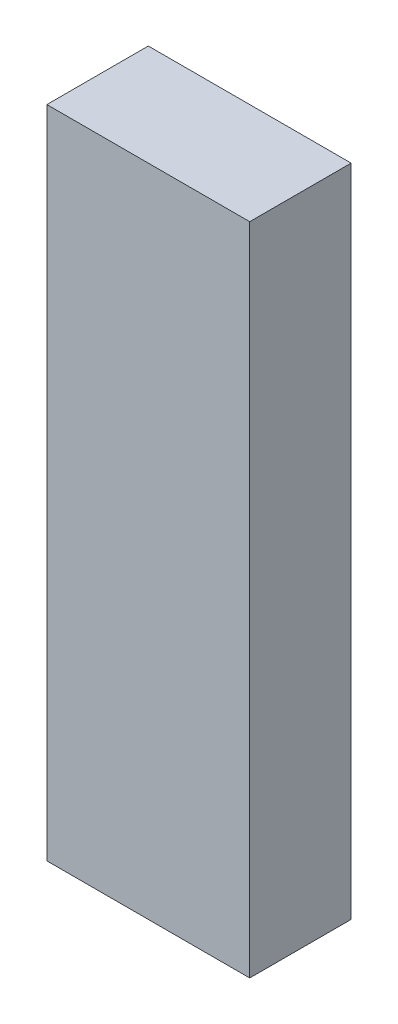
ISO-10303-21;
HEADER;
FILE_DESCRIPTION(('STEP AP214'),'2;1');
FILE_NAME('part.step','',(''),(''),'','','');
FILE_SCHEMA(('AUTOMOTIVE_DESIGN { 1 0 10303 214 1 1 1 1 }'));
ENDSEC;
DATA;
#1=APPLICATION_CONTEXT('core data for automotive mechanical design processes');
#2=APPLICATION_PROTOCOL_DEFINITION('international standard','automotive_design',2000,#1);
#3=PRODUCT_CONTEXT('',#1,'mechanical');
#4=PRODUCT('Part','Part','',(#3));
#5=PRODUCT_RELATED_PRODUCT_CATEGORY('part','',(#4));
#6=PRODUCT_DEFINITION_FORMATION('','',#4);
#7=PRODUCT_DEFINITION_CONTEXT('part definition',#1,'design');
#8=PRODUCT_DEFINITION('design','',#6,#7);
#9=PRODUCT_DEFINITION_SHAPE('','',#8);
#10=(LENGTH_UNIT() NAMED_UNIT(*) SI_UNIT(.MILLI.,.METRE.));
#11=(NAMED_UNIT(*) PLANE_ANGLE_UNIT() SI_UNIT($,.RADIAN.));
#12=(NAMED_UNIT(*) SI_UNIT($,.STERADIAN.) SOLID_ANGLE_UNIT());
#13=UNCERTAINTY_MEASURE_WITH_UNIT(LENGTH_MEASURE(1.E-05),#10,'distance_accuracy_value','');
#14=(GEOMETRIC_REPRESENTATION_CONTEXT(3) GLOBAL_UNCERTAINTY_ASSIGNED_CONTEXT((#13)) GLOBAL_UNIT_ASSIGNED_CONTEXT((#10,
#11,#12)) REPRESENTATION_CONTEXT('',''));
#15=CARTESIAN_POINT('',(0.,0.,0.));
#16=DIRECTION('',(0.,0.,1.));
#17=DIRECTION('',(1.,0.,0.));
#18=AXIS2_PLACEMENT_3D('',#15,#16,#17);
#19=CARTESIAN_POINT('',(24.,-77.5,24.));
#20=DIRECTION('',(-1.,0.,0.));
#21=DIRECTION('',(0.,0.,1.));
#22=AXIS2_PLACEMENT_3D('',#19,#20,#21);
#23=PLANE('',#22);
#24=DIRECTION('',(0.,1.,0.));
#25=VECTOR('',#24,1.);
#26=CARTESIAN_POINT('',(24.,-77.5,0.));
#27=LINE('',#26,#25);
#28=CARTESIAN_POINT('',(24.,-77.5,0.));
#29=VERTEX_POINT('',#28);
#30=CARTESIAN_POINT('',(24.,77.5,0.));
#31=VERTEX_POINT('',#30);
#32=EDGE_CURVE('E111',#29,#31,#27,.T.);
#33=ORIENTED_EDGE('',*,*,#32,.T.);
#34=DIRECTION('',(0.,0.,-1.));
#35=VECTOR('',#34,1.);
#36=CARTESIAN_POINT('',(24.,77.5,24.));
#37=LINE('',#36,#35);
#38=CARTESIAN_POINT('',(24.,77.5,24.));
#39=VERTEX_POINT('',#38);
#40=EDGE_CURVE('E11',#39,#31,#37,.T.);
#41=ORIENTED_EDGE('',*,*,#40,.F.);
#42=DIRECTION('',(0.,1.,0.));
#43=VECTOR('',#42,1.);
#44=CARTESIAN_POINT('',(24.,-77.5,24.));
#45=LINE('',#44,#43);
#46=CARTESIAN_POINT('',(24.,-77.5,24.));
#47=VERTEX_POINT('',#46);
#48=EDGE_CURVE('E95',#47,#39,#45,.T.);
#49=ORIENTED_EDGE('',*,*,#48,.F.);
#50=DIRECTION('',(0.,0.,-1.));
#51=VECTOR('',#50,1.);
#52=CARTESIAN_POINT('',(24.,-77.5,24.));
#53=LINE('',#52,#51);
#54=EDGE_CURVE('E107',#47,#29,#53,.T.);
#55=ORIENTED_EDGE('',*,*,#54,.T.);
#56=EDGE_LOOP('',(#33,#41,#49,#55));
#57=FACE_BOUND('',#56,.T.);
#58=ADVANCED_FACE('F43',(#57),#23,.F.);
#59=CARTESIAN_POINT('',(-24.,77.5,24.));
#60=DIRECTION('',(0.,-1.,0.));
#61=DIRECTION('',(0.,0.,-1.));
#62=AXIS2_PLACEMENT_3D('',#59,#60,#61);
#63=PLANE('',#62);
#64=DIRECTION('',(-1.,0.,0.));
#65=VECTOR('',#64,1.);
#66=CARTESIAN_POINT('',(-24.,77.5,0.));
#67=LINE('',#66,#65);
#68=CARTESIAN_POINT('',(-24.,77.5,0.));
#69=VERTEX_POINT('',#68);
#70=EDGE_CURVE('E100',#31,#69,#67,.T.);
#71=ORIENTED_EDGE('',*,*,#70,.T.);
#72=DIRECTION('',(0.,0.,-1.));
#73=VECTOR('',#72,1.);
#74=CARTESIAN_POINT('',(-24.,77.5,24.));
#75=LINE('',#74,#73);
#76=CARTESIAN_POINT('',(-24.,77.5,24.));
#77=VERTEX_POINT('',#76);
#78=EDGE_CURVE('E52',#77,#69,#75,.T.);
#79=ORIENTED_EDGE('',*,*,#78,.F.);
#80=DIRECTION('',(-1.,0.,0.));
#81=VECTOR('',#80,1.);
#82=CARTESIAN_POINT('',(-24.,77.5,24.));
#83=LINE('',#82,#81);
#84=EDGE_CURVE('E90',#39,#77,#83,.T.);
#85=ORIENTED_EDGE('',*,*,#84,.F.);
#86=ORIENTED_EDGE('',*,*,#40,.T.);
#87=EDGE_LOOP('',(#71,#79,#85,#86));
#88=FACE_BOUND('',#87,.T.);
#89=ADVANCED_FACE('F99',(#88),#63,.F.);
#90=CARTESIAN_POINT('',(-24.,-77.5,24.));
#91=DIRECTION('',(1.,0.,0.));
#92=DIRECTION('',(0.,0.,-1.));
#93=AXIS2_PLACEMENT_3D('',#90,#91,#92);
#94=PLANE('',#93);
#95=DIRECTION('',(0.,-1.,0.));
#96=VECTOR('',#95,1.);
#97=CARTESIAN_POINT('',(-24.,-77.5,0.));
#98=LINE('',#97,#96);
#99=CARTESIAN_POINT('',(-24.,-77.5,0.));
#100=VERTEX_POINT('',#99);
#101=EDGE_CURVE('E77',#69,#100,#98,.T.);
#102=ORIENTED_EDGE('',*,*,#101,.T.);
#103=DIRECTION('',(0.,0.,-1.));
#104=VECTOR('',#103,1.);
#105=CARTESIAN_POINT('',(-24.,-77.5,24.));
#106=LINE('',#105,#104);
#107=CARTESIAN_POINT('',(-24.,-77.5,24.));
#108=VERTEX_POINT('',#107);
#109=EDGE_CURVE('E102',#108,#100,#106,.T.);
#110=ORIENTED_EDGE('',*,*,#109,.F.);
#111=DIRECTION('',(0.,-1.,0.));
#112=VECTOR('',#111,1.);
#113=CARTESIAN_POINT('',(-24.,-77.5,24.));
#114=LINE('',#113,#112);
#115=EDGE_CURVE('E93',#77,#108,#114,.T.);
#116=ORIENTED_EDGE('',*,*,#115,.F.);
#117=ORIENTED_EDGE('',*,*,#78,.T.);
#118=EDGE_LOOP('',(#102,#110,#116,#117));
#119=FACE_BOUND('',#118,.T.);
#120=ADVANCED_FACE('F103',(#119),#94,.F.);
#121=CARTESIAN_POINT('',(-24.,-77.5,24.));
#122=DIRECTION('',(0.,1.,0.));
#123=DIRECTION('',(0.,0.,1.));
#124=AXIS2_PLACEMENT_3D('',#121,#122,#123);
#125=PLANE('',#124);
#126=DIRECTION('',(1.,0.,0.));
#127=VECTOR('',#126,1.);
#128=CARTESIAN_POINT('',(-24.,-77.5,0.));
#129=LINE('',#128,#127);
#130=EDGE_CURVE('E83',#100,#29,#129,.T.);
#131=ORIENTED_EDGE('',*,*,#130,.T.);
#132=ORIENTED_EDGE('',*,*,#54,.F.);
#133=DIRECTION('',(1.,0.,0.));
#134=VECTOR('',#133,1.);
#135=CARTESIAN_POINT('',(-24.,-77.5,24.));
#136=LINE('',#135,#134);
#137=EDGE_CURVE('E60',#108,#47,#136,.T.);
#138=ORIENTED_EDGE('',*,*,#137,.F.);
#139=ORIENTED_EDGE('',*,*,#109,.T.);
#140=EDGE_LOOP('',(#131,#132,#138,#139));
#141=FACE_BOUND('',#140,.T.);
#142=ADVANCED_FACE('F124',(#141),#125,.F.);
#143=CARTESIAN_POINT('',(0.,0.,24.));
#144=DIRECTION('',(0.,0.,-1.));
#145=DIRECTION('',(-1.,0.,0.));
#146=AXIS2_PLACEMENT_3D('',#143,#144,#145);
#147=PLANE('',#146);
#148=ORIENTED_EDGE('',*,*,#48,.T.);
#149=ORIENTED_EDGE('',*,*,#84,.T.);
#150=ORIENTED_EDGE('',*,*,#115,.T.);
#151=ORIENTED_EDGE('',*,*,#137,.T.);
#152=EDGE_LOOP('',(#148,#149,#150,#151));
#153=FACE_BOUND('',#152,.T.);
#154=ADVANCED_FACE('F91',(#153),#147,.F.);
#155=CARTESIAN_POINT('',(0.,0.,0.));
#156=DIRECTION('',(0.,0.,-1.));
#157=DIRECTION('',(-1.,0.,0.));
#158=AXIS2_PLACEMENT_3D('',#155,#156,#157);
#159=PLANE('',#158);
#160=ORIENTED_EDGE('',*,*,#32,.F.);
#161=ORIENTED_EDGE('',*,*,#130,.F.);
#162=ORIENTED_EDGE('',*,*,#101,.F.);
#163=ORIENTED_EDGE('',*,*,#70,.F.);
#164=EDGE_LOOP('',(#160,#161,#162,#163));
#165=FACE_BOUND('',#164,.T.);
#166=ADVANCED_FACE('F127',(#165),#159,.T.);
#167=CLOSED_SHELL('',(#58,#89,#120,#142,#154,#166));
#168=MANIFOLD_SOLID_BREP('B2',#167);
#169=ADVANCED_BREP_SHAPE_REPRESENTATION('',(#18,#168),#14);
#170=SHAPE_DEFINITION_REPRESENTATION(#9,#169);
ENDSEC;
END-ISO-10303-21;
